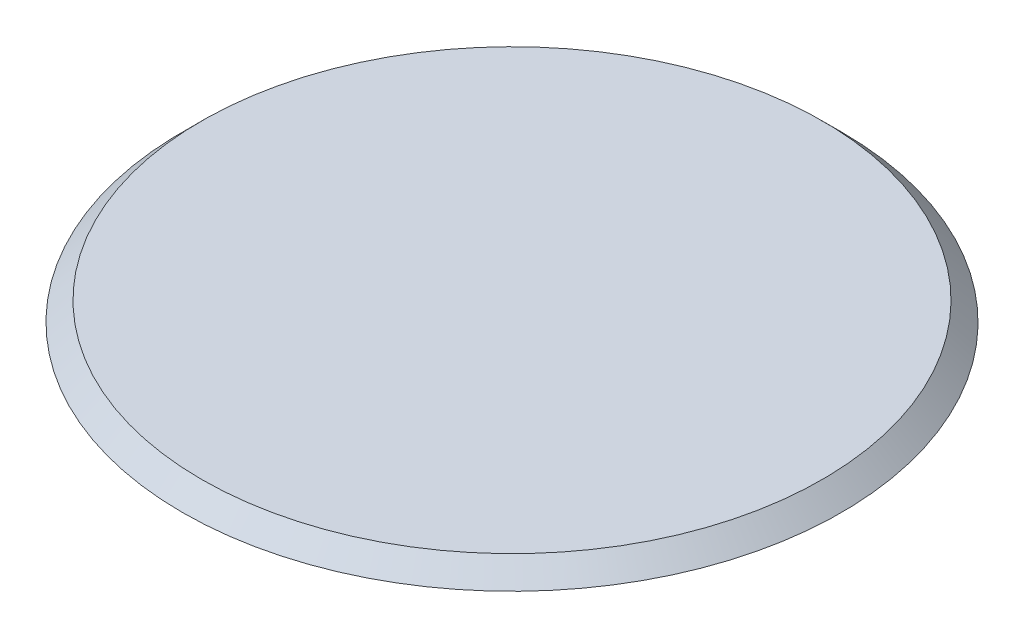
ISO-10303-21;
HEADER;
FILE_DESCRIPTION(('STEP AP214'),'2;1');
FILE_NAME('part.step','',(''),(''),'','','');
FILE_SCHEMA(('AUTOMOTIVE_DESIGN { 1 0 10303 214 1 1 1 1 }'));
ENDSEC;
DATA;
#1=APPLICATION_CONTEXT('core data for automotive mechanical design processes');
#2=APPLICATION_PROTOCOL_DEFINITION('international standard','automotive_design',2000,#1);
#3=PRODUCT_CONTEXT('',#1,'mechanical');
#4=PRODUCT('Part','Part','',(#3));
#5=PRODUCT_RELATED_PRODUCT_CATEGORY('part','',(#4));
#6=PRODUCT_DEFINITION_FORMATION('','',#4);
#7=PRODUCT_DEFINITION_CONTEXT('part definition',#1,'design');
#8=PRODUCT_DEFINITION('design','',#6,#7);
#9=PRODUCT_DEFINITION_SHAPE('','',#8);
#10=(LENGTH_UNIT() NAMED_UNIT(*) SI_UNIT(.MILLI.,.METRE.));
#11=(NAMED_UNIT(*) PLANE_ANGLE_UNIT() SI_UNIT($,.RADIAN.));
#12=(NAMED_UNIT(*) SI_UNIT($,.STERADIAN.) SOLID_ANGLE_UNIT());
#13=UNCERTAINTY_MEASURE_WITH_UNIT(LENGTH_MEASURE(1.E-05),#10,'distance_accuracy_value','');
#14=(GEOMETRIC_REPRESENTATION_CONTEXT(3) GLOBAL_UNCERTAINTY_ASSIGNED_CONTEXT((#13)) GLOBAL_UNIT_ASSIGNED_CONTEXT((#10,
#11,#12)) REPRESENTATION_CONTEXT('',''));
#15=CARTESIAN_POINT('',(0.,0.,0.));
#16=DIRECTION('',(0.,0.,1.));
#17=DIRECTION('',(1.,0.,0.));
#18=AXIS2_PLACEMENT_3D('',#15,#16,#17);
#19=CARTESIAN_POINT('',(0.,0.2,0.));
#20=DIRECTION('',(0.,1.,0.));
#21=DIRECTION('',(0.,0.,1.));
#22=AXIS2_PLACEMENT_3D('',#19,#20,#21);
#23=PLANE('',#22);
#24=CARTESIAN_POINT('',(0.,0.2,0.));
#25=DIRECTION('',(0.,1.,0.));
#26=DIRECTION('',(0.,0.,1.));
#27=AXIS2_PLACEMENT_3D('',#24,#25,#26);
#28=CIRCLE('',#27,3.25);
#29=CARTESIAN_POINT('',(0.,0.2,3.25));
#30=VERTEX_POINT('',#29);
#31=EDGE_CURVE('E10',#30,#30,#28,.T.);
#32=ORIENTED_EDGE('',*,*,#31,.T.);
#33=EDGE_LOOP('',(#32));
#34=FACE_BOUND('',#33,.T.);
#35=ADVANCED_FACE('F33',(#34),#23,.T.);
#36=CARTESIAN_POINT('',(0.,0.,0.));
#37=DIRECTION('',(0.,1.,0.));
#38=DIRECTION('',(0.,0.,1.));
#39=AXIS2_PLACEMENT_3D('',#36,#37,#38);
#40=PLANE('',#39);
#41=CARTESIAN_POINT('',(0.,0.,0.));
#42=DIRECTION('',(0.,1.,0.));
#43=DIRECTION('',(0.,0.,1.));
#44=AXIS2_PLACEMENT_3D('',#41,#42,#43);
#45=CIRCLE('',#44,3.45);
#46=CARTESIAN_POINT('',(0.,0.,3.45));
#47=VERTEX_POINT('',#46);
#48=EDGE_CURVE('E40',#47,#47,#45,.T.);
#49=ORIENTED_EDGE('',*,*,#48,.F.);
#50=EDGE_LOOP('',(#49));
#51=FACE_BOUND('',#50,.T.);
#52=ADVANCED_FACE('F48',(#51),#40,.F.);
#53=CARTESIAN_POINT('',(0.,0.2,0.));
#54=DIRECTION('',(0.,-1.,0.));
#55=DIRECTION('',(0.,0.,-1.));
#56=AXIS2_PLACEMENT_3D('',#53,#54,#55);
#57=CONICAL_SURFACE('',#56,3.25,0.785398163397446);
#58=ORIENTED_EDGE('',*,*,#48,.T.);
#59=EDGE_LOOP('',(#58));
#60=FACE_BOUND('',#59,.T.);
#61=ORIENTED_EDGE('',*,*,#31,.F.);
#62=EDGE_LOOP('',(#61));
#63=FACE_BOUND('',#62,.T.);
#64=ADVANCED_FACE('F35',(#60,#63),#57,.T.);
#65=CLOSED_SHELL('',(#35,#52,#64));
#66=MANIFOLD_SOLID_BREP('B2',#65);
#67=ADVANCED_BREP_SHAPE_REPRESENTATION('',(#18,#66),#14);
#68=SHAPE_DEFINITION_REPRESENTATION(#9,#67);
ENDSEC;
END-ISO-10303-21;
